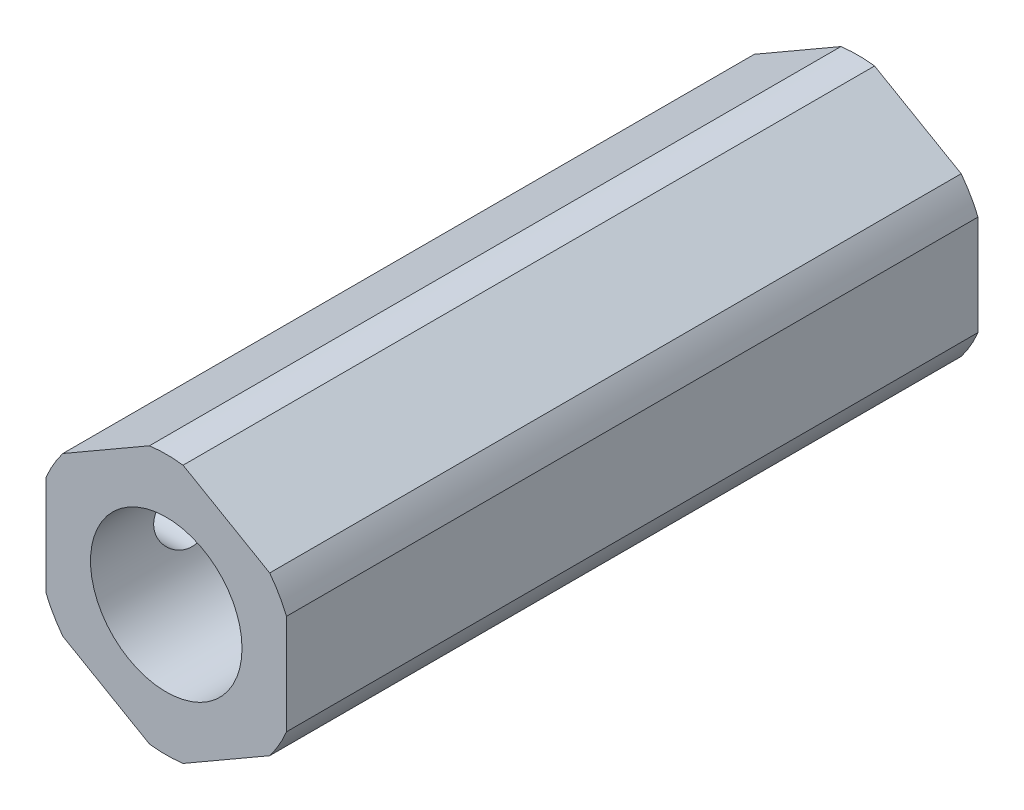
ISO-10303-21;
HEADER;
FILE_DESCRIPTION(('STEP AP214'),'2;1');
FILE_NAME('part.step','',(''),(''),'','','');
FILE_SCHEMA(('AUTOMOTIVE_DESIGN { 1 0 10303 214 1 1 1 1 }'));
ENDSEC;
DATA;
#1=APPLICATION_CONTEXT('core data for automotive mechanical design processes');
#2=APPLICATION_PROTOCOL_DEFINITION('international standard','automotive_design',2000,#1);
#3=PRODUCT_CONTEXT('',#1,'mechanical');
#4=PRODUCT('Part','Part','',(#3));
#5=PRODUCT_RELATED_PRODUCT_CATEGORY('part','',(#4));
#6=PRODUCT_DEFINITION_FORMATION('','',#4);
#7=PRODUCT_DEFINITION_CONTEXT('part definition',#1,'design');
#8=PRODUCT_DEFINITION('design','',#6,#7);
#9=PRODUCT_DEFINITION_SHAPE('','',#8);
#10=(LENGTH_UNIT() NAMED_UNIT(*) SI_UNIT(.MILLI.,.METRE.));
#11=(NAMED_UNIT(*) PLANE_ANGLE_UNIT() SI_UNIT($,.RADIAN.));
#12=(NAMED_UNIT(*) SI_UNIT($,.STERADIAN.) SOLID_ANGLE_UNIT());
#13=UNCERTAINTY_MEASURE_WITH_UNIT(LENGTH_MEASURE(1.E-05),#10,'distance_accuracy_value','');
#14=(GEOMETRIC_REPRESENTATION_CONTEXT(3) GLOBAL_UNCERTAINTY_ASSIGNED_CONTEXT((#13)) GLOBAL_UNIT_ASSIGNED_CONTEXT((#10,
#11,#12)) REPRESENTATION_CONTEXT('',''));
#15=CARTESIAN_POINT('',(0.,0.,0.));
#16=DIRECTION('',(0.,0.,1.));
#17=DIRECTION('',(1.,0.,0.));
#18=AXIS2_PLACEMENT_3D('',#15,#16,#17);
#19=CARTESIAN_POINT('',(0.,0.,-18.25625));
#20=DIRECTION('',(0.,0.,1.));
#21=DIRECTION('',(1.,0.,0.));
#22=AXIS2_PLACEMENT_3D('',#19,#20,#21);
#23=CYLINDRICAL_SURFACE('',#22,2.11582);
#24=CARTESIAN_POINT('',(0.,0.,-18.25625));
#25=DIRECTION('',(0.,0.,1.));
#26=DIRECTION('',(1.,0.,0.));
#27=AXIS2_PLACEMENT_3D('',#24,#25,#26);
#28=CIRCLE('',#27,2.11582);
#29=CARTESIAN_POINT('',(2.11582,0.,-18.25625));
#30=VERTEX_POINT('',#29);
#31=EDGE_CURVE('E166',#30,#30,#28,.T.);
#32=ORIENTED_EDGE('',*,*,#31,.F.);
#33=EDGE_LOOP('',(#32));
#34=FACE_BOUND('',#33,.T.);
#35=CARTESIAN_POINT('',(0.,0.,-1.74371));
#36=DIRECTION('',(0.,0.,1.));
#37=DIRECTION('',(1.,0.,0.));
#38=AXIS2_PLACEMENT_3D('',#35,#36,#37);
#39=CIRCLE('',#38,2.11582);
#40=CARTESIAN_POINT('',(2.11582,0.,-1.74371));
#41=VERTEX_POINT('',#40);
#42=EDGE_CURVE('E45',#41,#41,#39,.F.);
#43=ORIENTED_EDGE('',*,*,#42,.F.);
#44=EDGE_LOOP('',(#43));
#45=FACE_BOUND('',#44,.T.);
#46=ADVANCED_FACE('F41',(#34,#45),#23,.F.);
#47=CARTESIAN_POINT('',(0.,0.,18.25625));
#48=DIRECTION('',(0.,0.,1.));
#49=DIRECTION('',(1.,0.,0.));
#50=AXIS2_PLACEMENT_3D('',#47,#48,#49);
#51=PLANE('',#50);
#52=CARTESIAN_POINT('',(0.,0.,18.25625));
#53=DIRECTION('',(0.,0.,1.));
#54=DIRECTION('',(1.,0.,0.));
#55=AXIS2_PLACEMENT_3D('',#52,#53,#54);
#56=CIRCLE('',#55,4.);
#57=CARTESIAN_POINT('',(4.,0.,18.25625));
#58=VERTEX_POINT('',#57);
#59=EDGE_CURVE('E261',#58,#58,#56,.T.);
#60=ORIENTED_EDGE('',*,*,#59,.F.);
#61=EDGE_LOOP('',(#60));
#62=FACE_BOUND('',#61,.T.);
#63=CARTESIAN_POINT('',(0.,0.,18.25625));
#64=DIRECTION('',(0.,0.,1.));
#65=DIRECTION('',(1.,0.,0.));
#66=AXIS2_PLACEMENT_3D('',#63,#64,#65);
#67=CIRCLE('',#66,6.87705);
#68=CARTESIAN_POINT('',(5.46158862213451,-4.17909875751589,18.25625));
#69=VERTEX_POINT('',#68);
#70=CARTESIAN_POINT('',(6.35,-2.64032511303059,18.25625));
#71=VERTEX_POINT('',#70);
#72=EDGE_CURVE('E143',#69,#71,#67,.T.);
#73=ORIENTED_EDGE('',*,*,#72,.T.);
#74=DIRECTION('',(0.,1.,0.));
#75=VECTOR('',#74,1.);
#76=CARTESIAN_POINT('',(6.35,-2.64032511303059,18.25625));
#77=LINE('',#76,#75);
#78=CARTESIAN_POINT('',(6.35,2.64032511303059,18.25625));
#79=VERTEX_POINT('',#78);
#80=EDGE_CURVE('E137',#71,#79,#77,.T.);
#81=ORIENTED_EDGE('',*,*,#80,.T.);
#82=CARTESIAN_POINT('',(0.,0.,18.25625));
#83=DIRECTION('',(0.,0.,1.));
#84=DIRECTION('',(1.,0.,0.));
#85=AXIS2_PLACEMENT_3D('',#82,#83,#84);
#86=CIRCLE('',#85,6.87705);
#87=CARTESIAN_POINT('',(5.46158862213451,4.17909875751589,18.25625));
#88=VERTEX_POINT('',#87);
#89=EDGE_CURVE('E140',#79,#88,#86,.T.);
#90=ORIENTED_EDGE('',*,*,#89,.T.);
#91=DIRECTION('',(-0.866025403784439,0.499999999999999,0.));
#92=VECTOR('',#91,1.);
#93=CARTESIAN_POINT('',(5.46158862213451,4.17909875751589,18.25625));
#94=LINE('',#93,#92);
#95=CARTESIAN_POINT('',(0.888411377865485,6.81942387054648,18.25625));
#96=VERTEX_POINT('',#95);
#97=EDGE_CURVE('E59',#88,#96,#94,.T.);
#98=ORIENTED_EDGE('',*,*,#97,.T.);
#99=CARTESIAN_POINT('',(0.,0.,18.25625));
#100=DIRECTION('',(0.,0.,1.));
#101=DIRECTION('',(1.,0.,0.));
#102=AXIS2_PLACEMENT_3D('',#99,#100,#101);
#103=CIRCLE('',#102,6.87705);
#104=CARTESIAN_POINT('',(-0.88841137786549,6.81942387054648,18.25625));
#105=VERTEX_POINT('',#104);
#106=EDGE_CURVE('E190',#96,#105,#103,.T.);
#107=ORIENTED_EDGE('',*,*,#106,.T.);
#108=DIRECTION('',(-0.866025403784439,-0.5,0.));
#109=VECTOR('',#108,1.);
#110=CARTESIAN_POINT('',(-0.88841137786549,6.81942387054648,18.25625));
#111=LINE('',#110,#109);
#112=CARTESIAN_POINT('',(-5.46158862213451,4.17909875751589,18.25625));
#113=VERTEX_POINT('',#112);
#114=EDGE_CURVE('E112',#105,#113,#111,.T.);
#115=ORIENTED_EDGE('',*,*,#114,.T.);
#116=CARTESIAN_POINT('',(0.,0.,18.25625));
#117=DIRECTION('',(0.,0.,1.));
#118=DIRECTION('',(1.,0.,0.));
#119=AXIS2_PLACEMENT_3D('',#116,#117,#118);
#120=CIRCLE('',#119,6.87705);
#121=CARTESIAN_POINT('',(-6.35,2.64032511303059,18.25625));
#122=VERTEX_POINT('',#121);
#123=EDGE_CURVE('E218',#113,#122,#120,.T.);
#124=ORIENTED_EDGE('',*,*,#123,.T.);
#125=DIRECTION('',(0.,-1.,0.));
#126=VECTOR('',#125,1.);
#127=CARTESIAN_POINT('',(-6.35,2.64032511303059,18.25625));
#128=LINE('',#127,#126);
#129=CARTESIAN_POINT('',(-6.35,-2.64032511303059,18.25625));
#130=VERTEX_POINT('',#129);
#131=EDGE_CURVE('E232',#122,#130,#128,.T.);
#132=ORIENTED_EDGE('',*,*,#131,.T.);
#133=CARTESIAN_POINT('',(0.,0.,18.25625));
#134=DIRECTION('',(0.,0.,1.));
#135=DIRECTION('',(1.,0.,0.));
#136=AXIS2_PLACEMENT_3D('',#133,#134,#135);
#137=CIRCLE('',#136,6.87705);
#138=CARTESIAN_POINT('',(-5.46158862213451,-4.17909875751589,18.25625));
#139=VERTEX_POINT('',#138);
#140=EDGE_CURVE('E229',#130,#139,#137,.T.);
#141=ORIENTED_EDGE('',*,*,#140,.T.);
#142=DIRECTION('',(0.866025403784438,-0.5,0.));
#143=VECTOR('',#142,1.);
#144=CARTESIAN_POINT('',(-5.46158862213451,-4.17909875751589,18.25625));
#145=LINE('',#144,#143);
#146=CARTESIAN_POINT('',(-0.888411377865495,-6.81942387054648,18.25625));
#147=VERTEX_POINT('',#146);
#148=EDGE_CURVE('E231',#139,#147,#145,.T.);
#149=ORIENTED_EDGE('',*,*,#148,.T.);
#150=CARTESIAN_POINT('',(0.,0.,18.25625));
#151=DIRECTION('',(0.,0.,1.));
#152=DIRECTION('',(1.,0.,0.));
#153=AXIS2_PLACEMENT_3D('',#150,#151,#152);
#154=CIRCLE('',#153,6.87705);
#155=CARTESIAN_POINT('',(0.888411377865487,-6.81942387054648,18.25625));
#156=VERTEX_POINT('',#155);
#157=EDGE_CURVE('E234',#147,#156,#154,.T.);
#158=ORIENTED_EDGE('',*,*,#157,.T.);
#159=DIRECTION('',(0.866025403784439,0.5,0.));
#160=VECTOR('',#159,1.);
#161=CARTESIAN_POINT('',(0.88841137786549,-6.81942387054648,18.25625));
#162=LINE('',#161,#160);
#163=EDGE_CURVE('E240',#156,#69,#162,.T.);
#164=ORIENTED_EDGE('',*,*,#163,.T.);
#165=EDGE_LOOP('',(#73,#81,#90,#98,#107,#115,#124,#132,#141,#149,#158,#164));
#166=FACE_BOUND('',#165,.T.);
#167=ADVANCED_FACE('F43',(#62,#166),#51,.T.);
#168=CARTESIAN_POINT('',(-0.88841137786549,6.81942387054648,18.25625));
#169=DIRECTION('',(0.5,-0.866025403784439,0.));
#170=DIRECTION('',(0.866025403784439,0.5,0.));
#171=AXIS2_PLACEMENT_3D('',#168,#169,#170);
#172=PLANE('',#171);
#173=DIRECTION('',(0.,0.,-1.));
#174=VECTOR('',#173,1.);
#175=CARTESIAN_POINT('',(-5.46158862213451,4.17909875751589,18.25625));
#176=LINE('',#175,#174);
#177=CARTESIAN_POINT('',(-5.46158862213451,4.17909875751589,-18.25625));
#178=VERTEX_POINT('',#177);
#179=EDGE_CURVE('E51',#113,#178,#176,.T.);
#180=ORIENTED_EDGE('',*,*,#179,.F.);
#181=ORIENTED_EDGE('',*,*,#114,.F.);
#182=DIRECTION('',(0.,0.,-1.));
#183=VECTOR('',#182,1.);
#184=CARTESIAN_POINT('',(-0.88841137786549,6.81942387054648,18.25625));
#185=LINE('',#184,#183);
#186=CARTESIAN_POINT('',(-0.88841137786549,6.81942387054648,-18.25625));
#187=VERTEX_POINT('',#186);
#188=EDGE_CURVE('E11',#105,#187,#185,.T.);
#189=ORIENTED_EDGE('',*,*,#188,.T.);
#190=DIRECTION('',(-0.866025403784439,-0.5,0.));
#191=VECTOR('',#190,1.);
#192=CARTESIAN_POINT('',(-0.88841137786549,6.81942387054648,-18.25625));
#193=LINE('',#192,#191);
#194=EDGE_CURVE('E165',#187,#178,#193,.T.);
#195=ORIENTED_EDGE('',*,*,#194,.T.);
#196=EDGE_LOOP('',(#180,#181,#189,#195));
#197=FACE_BOUND('',#196,.T.);
#198=ADVANCED_FACE('F317',(#197),#172,.F.);
#199=CARTESIAN_POINT('',(-6.35,2.64032511303059,18.25625));
#200=DIRECTION('',(1.,0.,0.));
#201=DIRECTION('',(0.,0.,-1.));
#202=AXIS2_PLACEMENT_3D('',#199,#200,#201);
#203=PLANE('',#202);
#204=CARTESIAN_POINT('',(-6.35,0.,5.25399));
#205=DIRECTION('',(-1.,0.,0.));
#206=DIRECTION('',(0.,0.,1.));
#207=AXIS2_PLACEMENT_3D('',#204,#205,#206);
#208=CIRCLE('',#207,1.66624);
#209=CARTESIAN_POINT('',(-6.35,0.,6.92023));
#210=VERTEX_POINT('',#209);
#211=EDGE_CURVE('E265',#210,#210,#208,.T.);
#212=ORIENTED_EDGE('',*,*,#211,.F.);
#213=EDGE_LOOP('',(#212));
#214=FACE_BOUND('',#213,.T.);
#215=CARTESIAN_POINT('',(-6.35,0.,13.25499));
#216=DIRECTION('',(-1.,0.,0.));
#217=DIRECTION('',(0.,0.,1.));
#218=AXIS2_PLACEMENT_3D('',#215,#216,#217);
#219=CIRCLE('',#218,1.66624);
#220=CARTESIAN_POINT('',(-6.35,0.,14.92123));
#221=VERTEX_POINT('',#220);
#222=EDGE_CURVE('E277',#221,#221,#219,.T.);
#223=ORIENTED_EDGE('',*,*,#222,.F.);
#224=EDGE_LOOP('',(#223));
#225=FACE_BOUND('',#224,.T.);
#226=DIRECTION('',(0.,0.,-1.));
#227=VECTOR('',#226,1.);
#228=CARTESIAN_POINT('',(-6.35,-2.64032511303059,18.25625));
#229=LINE('',#228,#227);
#230=CARTESIAN_POINT('',(-6.35,-2.64032511303059,-18.25625));
#231=VERTEX_POINT('',#230);
#232=EDGE_CURVE('E206',#130,#231,#229,.T.);
#233=ORIENTED_EDGE('',*,*,#232,.F.);
#234=ORIENTED_EDGE('',*,*,#131,.F.);
#235=DIRECTION('',(0.,0.,-1.));
#236=VECTOR('',#235,1.);
#237=CARTESIAN_POINT('',(-6.35,2.64032511303059,18.25625));
#238=LINE('',#237,#236);
#239=CARTESIAN_POINT('',(-6.35,2.64032511303059,-18.25625));
#240=VERTEX_POINT('',#239);
#241=EDGE_CURVE('E209',#122,#240,#238,.T.);
#242=ORIENTED_EDGE('',*,*,#241,.T.);
#243=DIRECTION('',(0.,-1.,0.));
#244=VECTOR('',#243,1.);
#245=CARTESIAN_POINT('',(-6.35,2.64032511303059,-18.25625));
#246=LINE('',#245,#244);
#247=EDGE_CURVE('E171',#240,#231,#246,.T.);
#248=ORIENTED_EDGE('',*,*,#247,.T.);
#249=EDGE_LOOP('',(#233,#234,#242,#248));
#250=FACE_BOUND('',#249,.T.);
#251=ADVANCED_FACE('F223',(#214,#225,#250),#203,.F.);
#252=CARTESIAN_POINT('',(-5.46158862213451,-4.17909875751589,18.25625));
#253=DIRECTION('',(0.5,0.866025403784439,0.));
#254=DIRECTION('',(-0.866025403784439,0.5,0.));
#255=AXIS2_PLACEMENT_3D('',#252,#253,#254);
#256=PLANE('',#255);
#257=DIRECTION('',(0.,0.,-1.));
#258=VECTOR('',#257,1.);
#259=CARTESIAN_POINT('',(-0.888411377865495,-6.81942387054648,18.25625));
#260=LINE('',#259,#258);
#261=CARTESIAN_POINT('',(-0.888411377865495,-6.81942387054648,-18.25625));
#262=VERTEX_POINT('',#261);
#263=EDGE_CURVE('E200',#147,#262,#260,.T.);
#264=ORIENTED_EDGE('',*,*,#263,.F.);
#265=ORIENTED_EDGE('',*,*,#148,.F.);
#266=DIRECTION('',(0.,0.,-1.));
#267=VECTOR('',#266,1.);
#268=CARTESIAN_POINT('',(-5.46158862213451,-4.17909875751589,18.25625));
#269=LINE('',#268,#267);
#270=CARTESIAN_POINT('',(-5.46158862213451,-4.17909875751589,-18.25625));
#271=VERTEX_POINT('',#270);
#272=EDGE_CURVE('E203',#139,#271,#269,.T.);
#273=ORIENTED_EDGE('',*,*,#272,.T.);
#274=DIRECTION('',(0.866025403784438,-0.5,0.));
#275=VECTOR('',#274,1.);
#276=CARTESIAN_POINT('',(-5.46158862213451,-4.17909875751589,-18.25625));
#277=LINE('',#276,#275);
#278=EDGE_CURVE('E176',#271,#262,#277,.T.);
#279=ORIENTED_EDGE('',*,*,#278,.T.);
#280=EDGE_LOOP('',(#264,#265,#273,#279));
#281=FACE_BOUND('',#280,.T.);
#282=ADVANCED_FACE('F306',(#281),#256,.F.);
#283=CARTESIAN_POINT('',(0.88841137786549,-6.81942387054648,18.25625));
#284=DIRECTION('',(-0.5,0.866025403784439,0.));
#285=DIRECTION('',(-0.866025403784439,-0.5,0.));
#286=AXIS2_PLACEMENT_3D('',#283,#284,#285);
#287=PLANE('',#286);
#288=DIRECTION('',(0.,0.,-1.));
#289=VECTOR('',#288,1.);
#290=CARTESIAN_POINT('',(5.46158862213451,-4.17909875751589,18.25625));
#291=LINE('',#290,#289);
#292=CARTESIAN_POINT('',(5.46158862213451,-4.17909875751589,-18.25625));
#293=VERTEX_POINT('',#292);
#294=EDGE_CURVE('E194',#69,#293,#291,.T.);
#295=ORIENTED_EDGE('',*,*,#294,.F.);
#296=ORIENTED_EDGE('',*,*,#163,.F.);
#297=DIRECTION('',(0.,0.,-1.));
#298=VECTOR('',#297,1.);
#299=CARTESIAN_POINT('',(0.888411377865487,-6.81942387054648,18.25625));
#300=LINE('',#299,#298);
#301=CARTESIAN_POINT('',(0.888411377865487,-6.81942387054648,-18.25625));
#302=VERTEX_POINT('',#301);
#303=EDGE_CURVE('E197',#156,#302,#300,.T.);
#304=ORIENTED_EDGE('',*,*,#303,.T.);
#305=DIRECTION('',(0.866025403784439,0.5,0.));
#306=VECTOR('',#305,1.);
#307=CARTESIAN_POINT('',(0.88841137786549,-6.81942387054648,-18.25625));
#308=LINE('',#307,#306);
#309=EDGE_CURVE('E181',#302,#293,#308,.T.);
#310=ORIENTED_EDGE('',*,*,#309,.T.);
#311=EDGE_LOOP('',(#295,#296,#304,#310));
#312=FACE_BOUND('',#311,.T.);
#313=ADVANCED_FACE('F246',(#312),#287,.F.);
#314=CARTESIAN_POINT('',(6.35,-2.64032511303059,18.25625));
#315=DIRECTION('',(-1.,0.,0.));
#316=DIRECTION('',(0.,0.,1.));
#317=AXIS2_PLACEMENT_3D('',#314,#315,#316);
#318=PLANE('',#317);
#319=ORIENTED_EDGE('',*,*,#80,.F.);
#320=DIRECTION('',(0.,0.,-1.));
#321=VECTOR('',#320,1.);
#322=CARTESIAN_POINT('',(6.35,-2.64032511303059,18.25625));
#323=LINE('',#322,#321);
#324=CARTESIAN_POINT('',(6.35,-2.64032511303059,-18.25625));
#325=VERTEX_POINT('',#324);
#326=EDGE_CURVE('E153',#71,#325,#323,.T.);
#327=ORIENTED_EDGE('',*,*,#326,.T.);
#328=DIRECTION('',(0.,1.,0.));
#329=VECTOR('',#328,1.);
#330=CARTESIAN_POINT('',(6.35,-2.64032511303059,-18.25625));
#331=LINE('',#330,#329);
#332=CARTESIAN_POINT('',(6.35,2.64032511303059,-18.25625));
#333=VERTEX_POINT('',#332);
#334=EDGE_CURVE('E151',#325,#333,#331,.T.);
#335=ORIENTED_EDGE('',*,*,#334,.T.);
#336=DIRECTION('',(0.,0.,-1.));
#337=VECTOR('',#336,1.);
#338=CARTESIAN_POINT('',(6.35,2.64032511303059,18.25625));
#339=LINE('',#338,#337);
#340=EDGE_CURVE('E149',#79,#333,#339,.T.);
#341=ORIENTED_EDGE('',*,*,#340,.F.);
#342=EDGE_LOOP('',(#319,#327,#335,#341));
#343=FACE_BOUND('',#342,.T.);
#344=ADVANCED_FACE('F150',(#343),#318,.F.);
#345=CARTESIAN_POINT('',(5.46158862213451,4.17909875751589,18.25625));
#346=DIRECTION('',(-0.499999999999999,-0.866025403784439,0.));
#347=DIRECTION('',(0.866025403784439,-0.499999999999999,0.));
#348=AXIS2_PLACEMENT_3D('',#345,#346,#347);
#349=PLANE('',#348);
#350=DIRECTION('',(0.,0.,-1.));
#351=VECTOR('',#350,1.);
#352=CARTESIAN_POINT('',(0.888411377865485,6.81942387054648,18.25625));
#353=LINE('',#352,#351);
#354=CARTESIAN_POINT('',(0.888411377865485,6.81942387054648,-18.25625));
#355=VERTEX_POINT('',#354);
#356=EDGE_CURVE('E158',#96,#355,#353,.T.);
#357=ORIENTED_EDGE('',*,*,#356,.F.);
#358=ORIENTED_EDGE('',*,*,#97,.F.);
#359=DIRECTION('',(0.,0.,-1.));
#360=VECTOR('',#359,1.);
#361=CARTESIAN_POINT('',(5.46158862213451,4.17909875751589,18.25625));
#362=LINE('',#361,#360);
#363=CARTESIAN_POINT('',(5.46158862213451,4.17909875751589,-18.25625));
#364=VERTEX_POINT('',#363);
#365=EDGE_CURVE('E154',#88,#364,#362,.T.);
#366=ORIENTED_EDGE('',*,*,#365,.T.);
#367=DIRECTION('',(-0.866025403784439,0.499999999999999,0.));
#368=VECTOR('',#367,1.);
#369=CARTESIAN_POINT('',(5.46158862213451,4.17909875751589,-18.25625));
#370=LINE('',#369,#368);
#371=EDGE_CURVE('E100',#364,#355,#370,.T.);
#372=ORIENTED_EDGE('',*,*,#371,.T.);
#373=EDGE_LOOP('',(#357,#358,#366,#372));
#374=FACE_BOUND('',#373,.T.);
#375=ADVANCED_FACE('F251',(#374),#349,.F.);
#376=CARTESIAN_POINT('',(0.,0.,18.25625));
#377=DIRECTION('',(0.,0.,-1.));
#378=DIRECTION('',(-1.,0.,0.));
#379=AXIS2_PLACEMENT_3D('',#376,#377,#378);
#380=CYLINDRICAL_SURFACE('',#379,6.87705);
#381=CARTESIAN_POINT('',(0.,0.,-18.25625));
#382=DIRECTION('',(0.,0.,1.));
#383=DIRECTION('',(1.,0.,0.));
#384=AXIS2_PLACEMENT_3D('',#381,#382,#383);
#385=CIRCLE('',#384,6.87705);
#386=EDGE_CURVE('E162',#355,#187,#385,.T.);
#387=ORIENTED_EDGE('',*,*,#386,.T.);
#388=ORIENTED_EDGE('',*,*,#188,.F.);
#389=ORIENTED_EDGE('',*,*,#106,.F.);
#390=ORIENTED_EDGE('',*,*,#356,.T.);
#391=EDGE_LOOP('',(#387,#388,#389,#390));
#392=FACE_BOUND('',#391,.T.);
#393=ADVANCED_FACE('F255',(#392),#380,.T.);
#394=CARTESIAN_POINT('',(0.,0.,18.25625));
#395=DIRECTION('',(0.,0.,-1.));
#396=DIRECTION('',(-1.,0.,0.));
#397=AXIS2_PLACEMENT_3D('',#394,#395,#396);
#398=CYLINDRICAL_SURFACE('',#397,6.87705);
#399=CARTESIAN_POINT('',(0.,0.,-18.25625));
#400=DIRECTION('',(0.,0.,1.));
#401=DIRECTION('',(1.,0.,0.));
#402=AXIS2_PLACEMENT_3D('',#399,#400,#401);
#403=CIRCLE('',#402,6.87705);
#404=EDGE_CURVE('E168',#178,#240,#403,.T.);
#405=ORIENTED_EDGE('',*,*,#404,.T.);
#406=ORIENTED_EDGE('',*,*,#241,.F.);
#407=ORIENTED_EDGE('',*,*,#123,.F.);
#408=ORIENTED_EDGE('',*,*,#179,.T.);
#409=EDGE_LOOP('',(#405,#406,#407,#408));
#410=FACE_BOUND('',#409,.T.);
#411=ADVANCED_FACE('F216',(#410),#398,.T.);
#412=CARTESIAN_POINT('',(0.,0.,18.25625));
#413=DIRECTION('',(0.,0.,-1.));
#414=DIRECTION('',(-1.,0.,0.));
#415=AXIS2_PLACEMENT_3D('',#412,#413,#414);
#416=CYLINDRICAL_SURFACE('',#415,6.87705);
#417=CARTESIAN_POINT('',(0.,0.,-18.25625));
#418=DIRECTION('',(0.,0.,1.));
#419=DIRECTION('',(1.,0.,0.));
#420=AXIS2_PLACEMENT_3D('',#417,#418,#419);
#421=CIRCLE('',#420,6.87705);
#422=EDGE_CURVE('E173',#231,#271,#421,.T.);
#423=ORIENTED_EDGE('',*,*,#422,.T.);
#424=ORIENTED_EDGE('',*,*,#272,.F.);
#425=ORIENTED_EDGE('',*,*,#140,.F.);
#426=ORIENTED_EDGE('',*,*,#232,.T.);
#427=EDGE_LOOP('',(#423,#424,#425,#426));
#428=FACE_BOUND('',#427,.T.);
#429=ADVANCED_FACE('F227',(#428),#416,.T.);
#430=CARTESIAN_POINT('',(0.,0.,18.25625));
#431=DIRECTION('',(0.,0.,-1.));
#432=DIRECTION('',(-1.,0.,0.));
#433=AXIS2_PLACEMENT_3D('',#430,#431,#432);
#434=CYLINDRICAL_SURFACE('',#433,6.87705);
#435=CARTESIAN_POINT('',(0.,0.,-18.25625));
#436=DIRECTION('',(0.,0.,1.));
#437=DIRECTION('',(1.,0.,0.));
#438=AXIS2_PLACEMENT_3D('',#435,#436,#437);
#439=CIRCLE('',#438,6.87705);
#440=EDGE_CURVE('E178',#262,#302,#439,.T.);
#441=ORIENTED_EDGE('',*,*,#440,.T.);
#442=ORIENTED_EDGE('',*,*,#303,.F.);
#443=ORIENTED_EDGE('',*,*,#157,.F.);
#444=ORIENTED_EDGE('',*,*,#263,.T.);
#445=EDGE_LOOP('',(#441,#442,#443,#444));
#446=FACE_BOUND('',#445,.T.);
#447=ADVANCED_FACE('F303',(#446),#434,.T.);
#448=CARTESIAN_POINT('',(0.,0.,18.25625));
#449=DIRECTION('',(0.,0.,-1.));
#450=DIRECTION('',(-1.,0.,0.));
#451=AXIS2_PLACEMENT_3D('',#448,#449,#450);
#452=CYLINDRICAL_SURFACE('',#451,6.87705);
#453=CARTESIAN_POINT('',(0.,0.,-18.25625));
#454=DIRECTION('',(0.,0.,1.));
#455=DIRECTION('',(1.,0.,0.));
#456=AXIS2_PLACEMENT_3D('',#453,#454,#455);
#457=CIRCLE('',#456,6.87705);
#458=EDGE_CURVE('E183',#293,#325,#457,.T.);
#459=ORIENTED_EDGE('',*,*,#458,.T.);
#460=ORIENTED_EDGE('',*,*,#326,.F.);
#461=ORIENTED_EDGE('',*,*,#72,.F.);
#462=ORIENTED_EDGE('',*,*,#294,.T.);
#463=EDGE_LOOP('',(#459,#460,#461,#462));
#464=FACE_BOUND('',#463,.T.);
#465=ADVANCED_FACE('F249',(#464),#452,.T.);
#466=CARTESIAN_POINT('',(0.,0.,18.25625));
#467=DIRECTION('',(0.,0.,-1.));
#468=DIRECTION('',(-1.,0.,0.));
#469=AXIS2_PLACEMENT_3D('',#466,#467,#468);
#470=CYLINDRICAL_SURFACE('',#469,6.87705);
#471=CARTESIAN_POINT('',(0.,0.,-18.25625));
#472=DIRECTION('',(0.,0.,1.));
#473=DIRECTION('',(1.,0.,0.));
#474=AXIS2_PLACEMENT_3D('',#471,#472,#473);
#475=CIRCLE('',#474,6.87705);
#476=EDGE_CURVE('E187',#333,#364,#475,.T.);
#477=ORIENTED_EDGE('',*,*,#476,.T.);
#478=ORIENTED_EDGE('',*,*,#365,.F.);
#479=ORIENTED_EDGE('',*,*,#89,.F.);
#480=ORIENTED_EDGE('',*,*,#340,.T.);
#481=EDGE_LOOP('',(#477,#478,#479,#480));
#482=FACE_BOUND('',#481,.T.);
#483=ADVANCED_FACE('F156',(#482),#470,.T.);
#484=CARTESIAN_POINT('',(0.,0.,-18.25625));
#485=DIRECTION('',(0.,0.,1.));
#486=DIRECTION('',(1.,0.,0.));
#487=AXIS2_PLACEMENT_3D('',#484,#485,#486);
#488=PLANE('',#487);
#489=ORIENTED_EDGE('',*,*,#31,.T.);
#490=EDGE_LOOP('',(#489));
#491=FACE_BOUND('',#490,.T.);
#492=ORIENTED_EDGE('',*,*,#371,.F.);
#493=ORIENTED_EDGE('',*,*,#476,.F.);
#494=ORIENTED_EDGE('',*,*,#334,.F.);
#495=ORIENTED_EDGE('',*,*,#458,.F.);
#496=ORIENTED_EDGE('',*,*,#309,.F.);
#497=ORIENTED_EDGE('',*,*,#440,.F.);
#498=ORIENTED_EDGE('',*,*,#278,.F.);
#499=ORIENTED_EDGE('',*,*,#422,.F.);
#500=ORIENTED_EDGE('',*,*,#247,.F.);
#501=ORIENTED_EDGE('',*,*,#404,.F.);
#502=ORIENTED_EDGE('',*,*,#194,.F.);
#503=ORIENTED_EDGE('',*,*,#386,.F.);
#504=EDGE_LOOP('',(#492,#493,#494,#495,#496,#497,#498,#499,#500,#501,#502,#503));
#505=FACE_BOUND('',#504,.T.);
#506=ADVANCED_FACE('F219',(#491,#505),#488,.F.);
#507=CARTESIAN_POINT('',(0.,0.,-1.74371));
#508=DIRECTION('',(0.,0.,1.));
#509=DIRECTION('',(1.,0.,0.));
#510=AXIS2_PLACEMENT_3D('',#507,#508,#509);
#511=PLANE('',#510);
#512=CARTESIAN_POINT('',(0.,0.,-1.74371));
#513=DIRECTION('',(0.,0.,1.));
#514=DIRECTION('',(1.,0.,0.));
#515=AXIS2_PLACEMENT_3D('',#512,#513,#514);
#516=CIRCLE('',#515,4.);
#517=CARTESIAN_POINT('',(4.,0.,-1.74371));
#518=VERTEX_POINT('',#517);
#519=EDGE_CURVE('E264',#518,#518,#516,.T.);
#520=ORIENTED_EDGE('',*,*,#519,.T.);
#521=EDGE_LOOP('',(#520));
#522=FACE_BOUND('',#521,.T.);
#523=ORIENTED_EDGE('',*,*,#42,.T.);
#524=EDGE_LOOP('',(#523));
#525=FACE_BOUND('',#524,.T.);
#526=ADVANCED_FACE('F284',(#522,#525),#511,.T.);
#527=CARTESIAN_POINT('',(0.,0.,-1.74371));
#528=DIRECTION('',(0.,0.,1.));
#529=DIRECTION('',(1.,0.,0.));
#530=AXIS2_PLACEMENT_3D('',#527,#528,#529);
#531=CYLINDRICAL_SURFACE('',#530,4.);
#532=CARTESIAN_POINT('',(-4.,0.,6.92023));
#533=CARTESIAN_POINT('',(-3.99999278615686,-0.0892564950838415,6.92022040280254));
#534=CARTESIAN_POINT('',(-3.99697785252806,-0.178653445874408,6.91301558527574));
#535=CARTESIAN_POINT('',(-3.98520895826679,-0.354913741163095,6.884452092414));
#536=CARTESIAN_POINT('',(-3.97644001809522,-0.441769852844397,6.86305647226014));
#537=CARTESIAN_POINT('',(-3.95410531852721,-0.610109779316257,6.80703869123557));
#538=CARTESIAN_POINT('',(-3.94055581629255,-0.691610704733507,6.77246132557386));
#539=CARTESIAN_POINT('',(-3.90997942026184,-0.847576254002892,6.69124641094525));
#540=CARTESIAN_POINT('',(-3.89295358110795,-0.922043001867831,6.64461251851683));
#541=CARTESIAN_POINT('',(-3.85617282951429,-1.06568209919382,6.53813623619526));
#542=CARTESIAN_POINT('',(-3.83632857309114,-1.13445507097262,6.47778620974131));
#543=CARTESIAN_POINT('',(-3.79653535169262,-1.26124697953997,6.34666408823113));
#544=CARTESIAN_POINT('',(-3.77658633725556,-1.31926025676097,6.27588654325225));
#545=CARTESIAN_POINT('',(-3.73774506509654,-1.42570450011951,6.12169955300438));
#546=CARTESIAN_POINT('',(-3.71895300286823,-1.47352402441445,6.03784010728799));
#547=CARTESIAN_POINT('',(-3.68597008124344,-1.55420022100683,5.86237150274682));
#548=CARTESIAN_POINT('',(-3.671776853786,-1.58706459764031,5.77076636312467));
#549=CARTESIAN_POINT('',(-3.6505655523416,-1.63524863717173,5.58700337703232));
#550=CARTESIAN_POINT('',(-3.64323489229324,-1.65133690512306,5.49508453624132));
#551=CARTESIAN_POINT('',(-3.63567986362934,-1.66790999232106,5.30958216023385));
#552=CARTESIAN_POINT('',(-3.63545157880415,-1.66840341048233,5.21599957088439));
#553=CARTESIAN_POINT('',(-3.6418625319979,-1.65435174165026,5.03748011431818));
#554=CARTESIAN_POINT('',(-3.64797697270696,-1.64095589411801,4.95243015667124));
#555=CARTESIAN_POINT('',(-3.66549761588335,-1.60143357359013,4.78591779407019));
#556=CARTESIAN_POINT('',(-3.67690483115058,-1.57530466400881,4.70445607901305));
#557=CARTESIAN_POINT('',(-3.70398329076342,-1.51054865952292,4.54537621453368));
#558=CARTESIAN_POINT('',(-3.71974008581751,-1.47166750232053,4.46787670222262));
#559=CARTESIAN_POINT('',(-3.75372239167387,-1.38269032288985,4.32020087003671));
#560=CARTESIAN_POINT('',(-3.77194887463804,-1.33258987923482,4.2500274533443));
#561=CARTESIAN_POINT('',(-3.81068981593156,-1.21762843949499,4.1127575189551));
#562=CARTESIAN_POINT('',(-3.83126749499628,-1.15187813276033,4.04642151805151));
#563=CARTESIAN_POINT('',(-3.8710932221594,-1.00998203418172,3.92546235411565));
#564=CARTESIAN_POINT('',(-3.89034095839519,-0.933833816472899,3.87084193203169));
#565=CARTESIAN_POINT('',(-3.92589646388082,-0.770993354834364,3.773749925822));
#566=CARTESIAN_POINT('',(-3.94212620606392,-0.684098465523778,3.7315875244231));
#567=CARTESIAN_POINT('',(-3.96921825305863,-0.503600517363095,3.66274604569425));
#568=CARTESIAN_POINT('',(-3.9800835221702,-0.410001196065356,3.63605841589126));
#569=CARTESIAN_POINT('',(-3.99466874321172,-0.225106983862132,3.60051546259937));
#570=CARTESIAN_POINT('',(-3.99879697140909,-0.134040460858859,3.59063950690697));
#571=CARTESIAN_POINT('',(-4.00074606368991,0.0485347036548922,3.5859576391928));
#572=CARTESIAN_POINT('',(-3.99856873744886,0.140043210791823,3.59114740335498));
#573=CARTESIAN_POINT('',(-3.98841618421731,0.316126306841151,3.61571884097058));
#574=CARTESIAN_POINT('',(-3.98073386309435,0.400819702001764,3.63438389307467));
#575=CARTESIAN_POINT('',(-3.96065667675385,0.565780678490784,3.68437885881006));
#576=CARTESIAN_POINT('',(-3.94826121610917,0.646047699152414,3.71571037267068));
#577=CARTESIAN_POINT('',(-3.91946786054283,0.802691549338796,3.79117236751371));
#578=CARTESIAN_POINT('',(-3.90295760265426,0.878870098792285,3.83567017680343));
#579=CARTESIAN_POINT('',(-3.86769708757404,1.02295157864902,3.93579794432399));
#580=CARTESIAN_POINT('',(-3.84894589669467,1.09085103558651,3.9914325492779));
#581=CARTESIAN_POINT('',(-3.80956887713304,1.22154465917045,4.11690416857875));
#582=CARTESIAN_POINT('',(-3.78890481691924,1.28362770277841,4.18747180492768));
#583=CARTESIAN_POINT('',(-3.74923247333857,1.39526874940991,4.33835362254029));
#584=CARTESIAN_POINT('',(-3.73022456591773,1.44482391343902,4.41867000691534));
#585=CARTESIAN_POINT('',(-3.69589386836082,1.5305358471205,4.58842396567675));
#586=CARTESIAN_POINT('',(-3.68062729029319,1.56649218978061,4.67797494794984));
#587=CARTESIAN_POINT('',(-3.65628375609074,1.62251020402727,4.86269604763062));
#588=CARTESIAN_POINT('',(-3.64720170060919,1.64258497272038,4.95786146521449));
#589=CARTESIAN_POINT('',(-3.63703400080563,1.6649687384726,5.14321983782381));
#590=CARTESIAN_POINT('',(-3.63538683997242,1.66852587675845,5.23323196419882));
#591=CARTESIAN_POINT('',(-3.63878372032672,1.66110513275311,5.41251701634837));
#592=CARTESIAN_POINT('',(-3.6438267355733,1.6501294790713,5.50179005335021));
#593=CARTESIAN_POINT('',(-3.65952264526222,1.61500295937027,5.6727854375588));
#594=CARTESIAN_POINT('',(-3.66990374316815,1.59148854964911,5.75466585714655));
#595=CARTESIAN_POINT('',(-3.69489312111697,1.53257405322683,5.91333819706226));
#596=CARTESIAN_POINT('',(-3.70950258867739,1.49717062710361,5.99012868044955));
#597=CARTESIAN_POINT('',(-3.74239151805826,1.41303218325127,6.14147942498679));
#598=CARTESIAN_POINT('',(-3.76083879746375,1.36362371730694,6.21562815917783));
#599=CARTESIAN_POINT('',(-3.79885581326801,1.25382110358067,6.35497288299454));
#600=CARTESIAN_POINT('',(-3.81842593693409,1.19342314975632,6.42016575712254));
#601=CARTESIAN_POINT('',(-3.85819446481438,1.05813689614619,6.54462955388976));
#602=CARTESIAN_POINT('',(-3.87833493399613,0.982513913267836,6.60312415666989));
#603=CARTESIAN_POINT('',(-3.91554273539295,0.821778431995703,6.7066324365446));
#604=CARTESIAN_POINT('',(-3.93260866567196,0.73666163308493,6.7516399699446));
#605=CARTESIAN_POINT('',(-3.96149750963462,0.560677876142256,6.82592233523187));
#606=CARTESIAN_POINT('',(-3.97340250049154,0.469929359680299,6.8554451536949));
#607=CARTESIAN_POINT('',(-3.99096249657124,0.284318986119759,6.89853741385485));
#608=CARTESIAN_POINT('',(-3.99663706864898,0.189470984620403,6.91215680943497));
#609=CARTESIAN_POINT('',(-3.99963188353466,0.0628638204102654,6.9193439764965));
#610=CARTESIAN_POINT('',(-4.00000254107816,0.0314406240947047,6.92023338061535));
#611=CARTESIAN_POINT('',(-4.,0.,6.92023));
#612=B_SPLINE_CURVE_WITH_KNOTS('',3,(#532,#533,#534,#535,#536,#537,#538,#539,#540,#541,#542,
#543,#544,#545,#546,#547,#548,#549,#550,#551,#552,#553,#554,#555,#556,#557,#558,#559,#560,#561,
#562,#563,#564,#565,#566,#567,#568,#569,#570,#571,#572,#573,#574,#575,#576,#577,#578,#579,#580,
#581,#582,#583,#584,#585,#586,#587,#588,#589,#590,#591,#592,#593,#594,#595,#596,#597,#598,#599,
#600,#601,#602,#603,#604,#605,#606,#607,#608,#609,#610,#611),.UNSPECIFIED.,.T.,.F.,(4,2,2,2,2,2,
2,2,2,2,2,2,2,2,2,2,2,2,2,2,2,2,2,2,2,2,2,2,2,2,2,2,2,2,2,2,2,2,2,4),(0.,0.267680035063576,
0.53605970732993,0.8035353660556,1.07092999895302,1.35058652498936,1.63038973492234,
1.92395126311833,2.21736138764429,2.49664339440191,2.77577140390534,3.03351475440056,
3.29130744577816,3.55458445069367,3.81796539403565,4.10359255775945,4.3892864734055,
4.68156820581396,4.97368824794633,5.2473417122141,5.52091664653013,5.78092347326919,
6.04096315848467,6.30908012294111,6.57730919072873,6.86469808720153,7.15215205179526,
7.44369130849504,7.73498988926461,8.0038743566524,8.27271759527594,8.5290581685435,
8.78547080381735,9.05729658148384,9.32921668170301,9.6209270958206,9.91277018997307,
10.1997845504484,10.485894930612,10.5801852940437),.UNSPECIFIED.);
#613=CARTESIAN_POINT('',(-4.,0.,6.92023));
#614=VERTEX_POINT('',#613);
#615=EDGE_CURVE('E276',#614,#614,#612,.T.);
#616=ORIENTED_EDGE('',*,*,#615,.F.);
#617=EDGE_LOOP('',(#616));
#618=FACE_BOUND('',#617,.T.);
#619=CARTESIAN_POINT('',(-4.,0.,14.92123));
#620=CARTESIAN_POINT('',(-3.99999278615686,-0.0892564950838411,14.9212204028025));
#621=CARTESIAN_POINT('',(-3.99697785252806,-0.178653445874408,14.9140155852757));
#622=CARTESIAN_POINT('',(-3.98520895826679,-0.354913741163095,14.885452092414));
#623=CARTESIAN_POINT('',(-3.97644001809522,-0.441769852844397,14.8640564722601));
#624=CARTESIAN_POINT('',(-3.95410531852721,-0.610109779316257,14.8080386912356));
#625=CARTESIAN_POINT('',(-3.94055581629255,-0.691610704733507,14.7734613255739));
#626=CARTESIAN_POINT('',(-3.90997942026184,-0.847576254002892,14.6922464109452));
#627=CARTESIAN_POINT('',(-3.89295358110795,-0.92204300186783,14.6456125185168));
#628=CARTESIAN_POINT('',(-3.85617282951429,-1.06568209919381,14.5391362361953));
#629=CARTESIAN_POINT('',(-3.83632857309114,-1.13445507097262,14.4787862097413));
#630=CARTESIAN_POINT('',(-3.79653535169262,-1.26124697953997,14.3476640882311));
#631=CARTESIAN_POINT('',(-3.77658633725556,-1.31926025676097,14.2768865432523));
#632=CARTESIAN_POINT('',(-3.73774506509654,-1.42570450011951,14.1226995530044));
#633=CARTESIAN_POINT('',(-3.71895300286823,-1.47352402441445,14.038840107288));
#634=CARTESIAN_POINT('',(-3.68597008124344,-1.55420022100682,13.8633715027468));
#635=CARTESIAN_POINT('',(-3.671776853786,-1.58706459764031,13.7717663631247));
#636=CARTESIAN_POINT('',(-3.6505655523416,-1.63524863717173,13.5880033770323));
#637=CARTESIAN_POINT('',(-3.64323489229324,-1.65133690512306,13.4960845362413));
#638=CARTESIAN_POINT('',(-3.63567986362934,-1.66790999232106,13.3105821602338));
#639=CARTESIAN_POINT('',(-3.63545157880415,-1.66840341048233,13.2169995708844));
#640=CARTESIAN_POINT('',(-3.6418625319979,-1.65435174165026,13.0384801143182));
#641=CARTESIAN_POINT('',(-3.64797697270696,-1.640955894118,12.9534301566712));
#642=CARTESIAN_POINT('',(-3.66549761588335,-1.60143357359013,12.7869177940702));
#643=CARTESIAN_POINT('',(-3.67690483115058,-1.57530466400881,12.7054560790131));
#644=CARTESIAN_POINT('',(-3.70398329076342,-1.51054865952292,12.5463762145337));
#645=CARTESIAN_POINT('',(-3.71974008581751,-1.47166750232053,12.4688767022226));
#646=CARTESIAN_POINT('',(-3.75372239167387,-1.38269032288985,12.3212008700367));
#647=CARTESIAN_POINT('',(-3.77194887463805,-1.33258987923482,12.2510274533443));
#648=CARTESIAN_POINT('',(-3.81068981593156,-1.21762843949499,12.1137575189551));
#649=CARTESIAN_POINT('',(-3.83126749499628,-1.15187813276033,12.0474215180515));
#650=CARTESIAN_POINT('',(-3.8710932221594,-1.00998203418172,11.9264623541157));
#651=CARTESIAN_POINT('',(-3.89034095839519,-0.933833816472897,11.8718419320317));
#652=CARTESIAN_POINT('',(-3.92589646388082,-0.770993354834362,11.774749925822));
#653=CARTESIAN_POINT('',(-3.94212620606392,-0.684098465523776,11.7325875244231));
#654=CARTESIAN_POINT('',(-3.96921825305863,-0.503600517363093,11.6637460456943));
#655=CARTESIAN_POINT('',(-3.9800835221702,-0.410001196065355,11.6370584158913));
#656=CARTESIAN_POINT('',(-3.99466874321172,-0.225106983862132,11.6015154625994));
#657=CARTESIAN_POINT('',(-3.99879697140909,-0.134040460858858,11.591639506907));
#658=CARTESIAN_POINT('',(-4.00074606368991,0.0485347036548926,11.5869576391928));
#659=CARTESIAN_POINT('',(-3.99856873744886,0.140043210791823,11.592147403355));
#660=CARTESIAN_POINT('',(-3.98841618421731,0.316126306841151,11.6167188409706));
#661=CARTESIAN_POINT('',(-3.98073386309435,0.400819702001765,11.6353838930747));
#662=CARTESIAN_POINT('',(-3.96065667675385,0.565780678490784,11.6853788588101));
#663=CARTESIAN_POINT('',(-3.94826121610917,0.646047699152414,11.7167103726707));
#664=CARTESIAN_POINT('',(-3.91946786054283,0.802691549338796,11.7921723675137));
#665=CARTESIAN_POINT('',(-3.90295760265426,0.878870098792285,11.8366701768034));
#666=CARTESIAN_POINT('',(-3.86769708757404,1.02295157864902,11.936797944324));
#667=CARTESIAN_POINT('',(-3.84894589669467,1.09085103558651,11.9924325492779));
#668=CARTESIAN_POINT('',(-3.80956887713304,1.22154465917045,12.1179041685788));
#669=CARTESIAN_POINT('',(-3.78890481691924,1.28362770277841,12.1884718049277));
#670=CARTESIAN_POINT('',(-3.74923247333857,1.39526874940991,12.3393536225403));
#671=CARTESIAN_POINT('',(-3.73022456591773,1.44482391343902,12.4196700069153));
#672=CARTESIAN_POINT('',(-3.69589386836082,1.5305358471205,12.5894239656767));
#673=CARTESIAN_POINT('',(-3.68062729029319,1.56649218978061,12.6789749479498));
#674=CARTESIAN_POINT('',(-3.65628375609074,1.62251020402727,12.8636960476306));
#675=CARTESIAN_POINT('',(-3.64720170060919,1.64258497272038,12.9588614652145));
#676=CARTESIAN_POINT('',(-3.63703400080563,1.6649687384726,13.1442198378238));
#677=CARTESIAN_POINT('',(-3.63538683997242,1.66852587675845,13.2342319641988));
#678=CARTESIAN_POINT('',(-3.63878372032672,1.6611051327531,13.4135170163484));
#679=CARTESIAN_POINT('',(-3.6438267355733,1.6501294790713,13.5027900533502));
#680=CARTESIAN_POINT('',(-3.65952264526222,1.61500295937027,13.6737854375588));
#681=CARTESIAN_POINT('',(-3.66990374316815,1.59148854964911,13.7556658571466));
#682=CARTESIAN_POINT('',(-3.69489312111697,1.53257405322683,13.9143381970623));
#683=CARTESIAN_POINT('',(-3.70950258867739,1.4971706271036,13.9911286804496));
#684=CARTESIAN_POINT('',(-3.74239151805826,1.41303218325127,14.1424794249868));
#685=CARTESIAN_POINT('',(-3.76083879746375,1.36362371730694,14.2166281591778));
#686=CARTESIAN_POINT('',(-3.79885581326801,1.25382110358067,14.3559728829945));
#687=CARTESIAN_POINT('',(-3.81842593693409,1.19342314975632,14.4211657571225));
#688=CARTESIAN_POINT('',(-3.85819446481438,1.05813689614619,14.5456295538898));
#689=CARTESIAN_POINT('',(-3.87833493399613,0.982513913267836,14.6041241566699));
#690=CARTESIAN_POINT('',(-3.91554273539295,0.821778431995702,14.7076324365446));
#691=CARTESIAN_POINT('',(-3.93260866567196,0.736661633084929,14.7526399699446));
#692=CARTESIAN_POINT('',(-3.96149750963462,0.560677876142255,14.8269223352319));
#693=CARTESIAN_POINT('',(-3.97340250049154,0.469929359680297,14.8564451536949));
#694=CARTESIAN_POINT('',(-3.99096249657124,0.284318986119757,14.8995374138548));
#695=CARTESIAN_POINT('',(-3.99663706864898,0.189470984620401,14.913156809435));
#696=CARTESIAN_POINT('',(-3.99963188353466,0.0628638204102647,14.9203439764965));
#697=CARTESIAN_POINT('',(-4.00000254107816,0.0314406240947045,14.9212333806154));
#698=CARTESIAN_POINT('',(-4.,0.,14.92123));
#699=B_SPLINE_CURVE_WITH_KNOTS('',3,(#619,#620,#621,#622,#623,#624,#625,#626,#627,#628,#629,
#630,#631,#632,#633,#634,#635,#636,#637,#638,#639,#640,#641,#642,#643,#644,#645,#646,#647,#648,
#649,#650,#651,#652,#653,#654,#655,#656,#657,#658,#659,#660,#661,#662,#663,#664,#665,#666,#667,
#668,#669,#670,#671,#672,#673,#674,#675,#676,#677,#678,#679,#680,#681,#682,#683,#684,#685,#686,
#687,#688,#689,#690,#691,#692,#693,#694,#695,#696,#697,#698),.UNSPECIFIED.,.T.,.F.,(4,2,2,2,2,2,
2,2,2,2,2,2,2,2,2,2,2,2,2,2,2,2,2,2,2,2,2,2,2,2,2,2,2,2,2,2,2,2,2,4),(0.,0.267680035063576,
0.53605970732993,0.803535366055601,1.07092999895302,1.35058652498936,1.63038973492234,
1.92395126311833,2.21736138764429,2.49664339440191,2.77577140390533,3.03351475440056,
3.29130744577815,3.55458445069366,3.81796539403564,4.10359255775945,4.38928647340549,
4.68156820581396,4.97368824794633,5.2473417122141,5.52091664653012,5.78092347326918,
6.04096315848466,6.3090801229411,6.57730919072872,6.86469808720153,7.15215205179525,
7.44369130849504,7.7349898892646,8.00387435665239,8.27271759527594,8.52905816854349,
8.78547080381734,9.05729658148382,9.32921668170299,9.62092709582059,9.91277018997306,
10.1997845504484,10.485894930612,10.5801852940437),.UNSPECIFIED.);
#700=CARTESIAN_POINT('',(-4.,0.,14.92123));
#701=VERTEX_POINT('',#700);
#702=EDGE_CURVE('E268',#701,#701,#699,.T.);
#703=ORIENTED_EDGE('',*,*,#702,.F.);
#704=EDGE_LOOP('',(#703));
#705=FACE_BOUND('',#704,.T.);
#706=ORIENTED_EDGE('',*,*,#519,.F.);
#707=EDGE_LOOP('',(#706));
#708=FACE_BOUND('',#707,.T.);
#709=ORIENTED_EDGE('',*,*,#59,.T.);
#710=EDGE_LOOP('',(#709));
#711=FACE_BOUND('',#710,.T.);
#712=ADVANCED_FACE('F287',(#618,#705,#708,#711),#531,.F.);
#713=CARTESIAN_POINT('',(6.351,0.,13.25499));
#714=DIRECTION('',(-1.,0.,0.));
#715=DIRECTION('',(0.,0.,1.));
#716=AXIS2_PLACEMENT_3D('',#713,#714,#715);
#717=CYLINDRICAL_SURFACE('',#716,1.66624);
#718=ORIENTED_EDGE('',*,*,#222,.T.);
#719=EDGE_LOOP('',(#718));
#720=FACE_BOUND('',#719,.T.);
#721=ORIENTED_EDGE('',*,*,#702,.T.);
#722=EDGE_LOOP('',(#721));
#723=FACE_BOUND('',#722,.T.);
#724=ADVANCED_FACE('F279',(#720,#723),#717,.F.);
#725=CARTESIAN_POINT('',(6.351,0.,5.25399));
#726=DIRECTION('',(-1.,0.,0.));
#727=DIRECTION('',(0.,0.,1.));
#728=AXIS2_PLACEMENT_3D('',#725,#726,#727);
#729=CYLINDRICAL_SURFACE('',#728,1.66624);
#730=ORIENTED_EDGE('',*,*,#211,.T.);
#731=EDGE_LOOP('',(#730));
#732=FACE_BOUND('',#731,.T.);
#733=ORIENTED_EDGE('',*,*,#615,.T.);
#734=EDGE_LOOP('',(#733));
#735=FACE_BOUND('',#734,.T.);
#736=ADVANCED_FACE('F352',(#732,#735),#729,.F.);
#737=CLOSED_SHELL('',(#46,#167,#198,#251,#282,#313,#344,#375,#393,#411,#429,#447,#465,#483,#506,
#526,#712,#724,#736));
#738=MANIFOLD_SOLID_BREP('B2',#737);
#739=ADVANCED_BREP_SHAPE_REPRESENTATION('',(#18,#738),#14);
#740=SHAPE_DEFINITION_REPRESENTATION(#9,#739);
ENDSEC;
END-ISO-10303-21;
